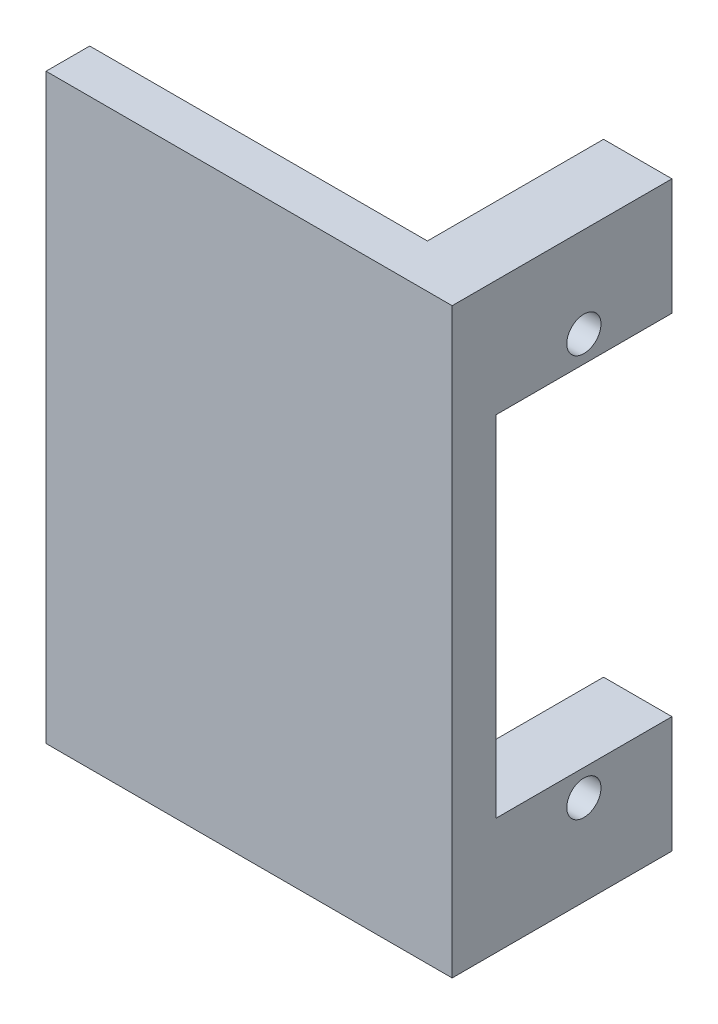
ISO-10303-21;
HEADER;
FILE_DESCRIPTION(('STEP AP214'),'2;1');
FILE_NAME('part.step','',(''),(''),'','','');
FILE_SCHEMA(('AUTOMOTIVE_DESIGN { 1 0 10303 214 1 1 1 1 }'));
ENDSEC;
DATA;
#1=APPLICATION_CONTEXT('core data for automotive mechanical design processes');
#2=APPLICATION_PROTOCOL_DEFINITION('international standard','automotive_design',2000,#1);
#3=PRODUCT_CONTEXT('',#1,'mechanical');
#4=PRODUCT('Part','Part','',(#3));
#5=PRODUCT_RELATED_PRODUCT_CATEGORY('part','',(#4));
#6=PRODUCT_DEFINITION_FORMATION('','',#4);
#7=PRODUCT_DEFINITION_CONTEXT('part definition',#1,'design');
#8=PRODUCT_DEFINITION('design','',#6,#7);
#9=PRODUCT_DEFINITION_SHAPE('','',#8);
#10=(LENGTH_UNIT() NAMED_UNIT(*) SI_UNIT(.MILLI.,.METRE.));
#11=(NAMED_UNIT(*) PLANE_ANGLE_UNIT() SI_UNIT($,.RADIAN.));
#12=(NAMED_UNIT(*) SI_UNIT($,.STERADIAN.) SOLID_ANGLE_UNIT());
#13=UNCERTAINTY_MEASURE_WITH_UNIT(LENGTH_MEASURE(1.E-05),#10,'distance_accuracy_value','');
#14=(GEOMETRIC_REPRESENTATION_CONTEXT(3) GLOBAL_UNCERTAINTY_ASSIGNED_CONTEXT((#13)) GLOBAL_UNIT_ASSIGNED_CONTEXT((#10,
#11,#12)) REPRESENTATION_CONTEXT('',''));
#15=CARTESIAN_POINT('',(0.,0.,0.));
#16=DIRECTION('',(0.,0.,1.));
#17=DIRECTION('',(1.,0.,0.));
#18=AXIS2_PLACEMENT_3D('',#15,#16,#17);
#19=CARTESIAN_POINT('',(0.,40.,-12.1));
#20=DIRECTION('',(1.,0.,0.));
#21=DIRECTION('',(0.,0.,-1.));
#22=AXIS2_PLACEMENT_3D('',#19,#20,#21);
#23=PLANE('',#22);
#24=CARTESIAN_POINT('',(0.,6.2,-6.05));
#25=DIRECTION('',(1.,0.,0.));
#26=DIRECTION('',(0.,0.,-1.));
#27=AXIS2_PLACEMENT_3D('',#24,#25,#26);
#28=CIRCLE('',#27,1.175);
#29=CARTESIAN_POINT('',(0.,6.2,-7.225));
#30=VERTEX_POINT('',#29);
#31=EDGE_CURVE('E251',#30,#30,#28,.F.);
#32=ORIENTED_EDGE('',*,*,#31,.F.);
#33=EDGE_LOOP('',(#32));
#34=FACE_BOUND('',#33,.T.);
#35=DIRECTION('',(0.,-1.,0.));
#36=VECTOR('',#35,1.);
#37=CARTESIAN_POINT('',(0.,40.,0.));
#38=LINE('',#37,#36);
#39=CARTESIAN_POINT('',(0.,8.,0.));
#40=VERTEX_POINT('',#39);
#41=CARTESIAN_POINT('',(0.,0.,0.));
#42=VERTEX_POINT('',#41);
#43=EDGE_CURVE('E48',#40,#42,#38,.T.);
#44=ORIENTED_EDGE('',*,*,#43,.F.);
#45=DIRECTION('',(0.,0.,1.));
#46=VECTOR('',#45,1.);
#47=CARTESIAN_POINT('',(0.,8.,0.));
#48=LINE('',#47,#46);
#49=CARTESIAN_POINT('',(0.,8.,-12.1));
#50=VERTEX_POINT('',#49);
#51=EDGE_CURVE('E230',#50,#40,#48,.T.);
#52=ORIENTED_EDGE('',*,*,#51,.F.);
#53=DIRECTION('',(0.,-1.,0.));
#54=VECTOR('',#53,1.);
#55=CARTESIAN_POINT('',(0.,40.,-12.1));
#56=LINE('',#55,#54);
#57=CARTESIAN_POINT('',(0.,0.,-12.1));
#58=VERTEX_POINT('',#57);
#59=EDGE_CURVE('E92',#50,#58,#56,.T.);
#60=ORIENTED_EDGE('',*,*,#59,.T.);
#61=DIRECTION('',(0.,0.,1.));
#62=VECTOR('',#61,1.);
#63=CARTESIAN_POINT('',(0.,0.,-12.1));
#64=LINE('',#63,#62);
#65=EDGE_CURVE('E145',#58,#42,#64,.T.);
#66=ORIENTED_EDGE('',*,*,#65,.T.);
#67=EDGE_LOOP('',(#44,#52,#60,#66));
#68=FACE_BOUND('',#67,.T.);
#69=ADVANCED_FACE('F39',(#34,#68),#23,.F.);
#70=CARTESIAN_POINT('',(0.,40.,-12.1));
#71=DIRECTION('',(0.,0.,1.));
#72=DIRECTION('',(1.,0.,0.));
#73=AXIS2_PLACEMENT_3D('',#70,#71,#72);
#74=PLANE('',#73);
#75=ORIENTED_EDGE('',*,*,#59,.F.);
#76=DIRECTION('',(1.,0.,0.));
#77=VECTOR('',#76,1.);
#78=CARTESIAN_POINT('',(-26.8776859122953,8.,-12.1));
#79=LINE('',#78,#77);
#80=CARTESIAN_POINT('',(4.7,8.,-12.1));
#81=VERTEX_POINT('',#80);
#82=EDGE_CURVE('E238',#50,#81,#79,.T.);
#83=ORIENTED_EDGE('',*,*,#82,.T.);
#84=DIRECTION('',(0.,-1.,0.));
#85=VECTOR('',#84,1.);
#86=CARTESIAN_POINT('',(4.7,40.,-12.1));
#87=LINE('',#86,#85);
#88=CARTESIAN_POINT('',(4.7,0.,-12.1));
#89=VERTEX_POINT('',#88);
#90=EDGE_CURVE('E167',#81,#89,#87,.T.);
#91=ORIENTED_EDGE('',*,*,#90,.T.);
#92=DIRECTION('',(-1.,0.,0.));
#93=VECTOR('',#92,1.);
#94=CARTESIAN_POINT('',(0.,0.,-12.1));
#95=LINE('',#94,#93);
#96=EDGE_CURVE('E159',#89,#58,#95,.T.);
#97=ORIENTED_EDGE('',*,*,#96,.T.);
#98=EDGE_LOOP('',(#75,#83,#91,#97));
#99=FACE_BOUND('',#98,.T.);
#100=ADVANCED_FACE('F189',(#99),#74,.F.);
#101=CARTESIAN_POINT('',(0.,33.8,-6.05));
#102=DIRECTION('',(1.,0.,0.));
#103=DIRECTION('',(0.,0.,-1.));
#104=AXIS2_PLACEMENT_3D('',#101,#102,#103);
#105=CIRCLE('',#104,1.175);
#106=CARTESIAN_POINT('',(0.,33.8,-7.225));
#107=VERTEX_POINT('',#106);
#108=EDGE_CURVE('E207',#107,#107,#105,.F.);
#109=ORIENTED_EDGE('',*,*,#108,.F.);
#110=EDGE_LOOP('',(#109));
#111=FACE_BOUND('',#110,.T.);
#112=CARTESIAN_POINT('',(0.,40.,-12.1));
#113=VERTEX_POINT('',#112);
#114=CARTESIAN_POINT('',(0.,32.,-12.1));
#115=VERTEX_POINT('',#114);
#116=EDGE_CURVE('E163',#113,#115,#56,.T.);
#117=ORIENTED_EDGE('',*,*,#116,.T.);
#118=DIRECTION('',(0.,0.,-1.));
#119=VECTOR('',#118,1.);
#120=CARTESIAN_POINT('',(0.,32.,0.));
#121=LINE('',#120,#119);
#122=CARTESIAN_POINT('',(0.,32.,0.));
#123=VERTEX_POINT('',#122);
#124=EDGE_CURVE('E55',#123,#115,#121,.T.);
#125=ORIENTED_EDGE('',*,*,#124,.F.);
#126=CARTESIAN_POINT('',(0.,40.,0.));
#127=VERTEX_POINT('',#126);
#128=EDGE_CURVE('E11',#127,#123,#38,.T.);
#129=ORIENTED_EDGE('',*,*,#128,.F.);
#130=DIRECTION('',(0.,0.,1.));
#131=VECTOR('',#130,1.);
#132=CARTESIAN_POINT('',(0.,40.,-12.1));
#133=LINE('',#132,#131);
#134=EDGE_CURVE('E162',#113,#127,#133,.T.);
#135=ORIENTED_EDGE('',*,*,#134,.F.);
#136=EDGE_LOOP('',(#117,#125,#129,#135));
#137=FACE_BOUND('',#136,.T.);
#138=ADVANCED_FACE('F41',(#111,#137),#23,.F.);
#139=CARTESIAN_POINT('',(-23.2,40.,0.));
#140=DIRECTION('',(0.,0.,1.));
#141=DIRECTION('',(1.,0.,0.));
#142=AXIS2_PLACEMENT_3D('',#139,#140,#141);
#143=PLANE('',#142);
#144=DIRECTION('',(-1.,0.,0.));
#145=VECTOR('',#144,1.);
#146=CARTESIAN_POINT('',(-23.2,0.,0.));
#147=LINE('',#146,#145);
#148=CARTESIAN_POINT('',(-23.2,0.,0.));
#149=VERTEX_POINT('',#148);
#150=EDGE_CURVE('E148',#42,#149,#147,.T.);
#151=ORIENTED_EDGE('',*,*,#150,.T.);
#152=DIRECTION('',(0.,-1.,0.));
#153=VECTOR('',#152,1.);
#154=CARTESIAN_POINT('',(-23.2,40.,0.));
#155=LINE('',#154,#153);
#156=CARTESIAN_POINT('',(-23.2,40.,0.));
#157=VERTEX_POINT('',#156);
#158=EDGE_CURVE('E171',#157,#149,#155,.T.);
#159=ORIENTED_EDGE('',*,*,#158,.F.);
#160=DIRECTION('',(-1.,0.,0.));
#161=VECTOR('',#160,1.);
#162=CARTESIAN_POINT('',(-23.2,40.,0.));
#163=LINE('',#162,#161);
#164=EDGE_CURVE('E100',#127,#157,#163,.T.);
#165=ORIENTED_EDGE('',*,*,#164,.F.);
#166=ORIENTED_EDGE('',*,*,#128,.T.);
#167=DIRECTION('',(1.,0.,0.));
#168=VECTOR('',#167,1.);
#169=CARTESIAN_POINT('',(-26.8776859122953,32.,0.));
#170=LINE('',#169,#168);
#171=CARTESIAN_POINT('',(4.7,32.,0.));
#172=VERTEX_POINT('',#171);
#173=EDGE_CURVE('E216',#123,#172,#170,.T.);
#174=ORIENTED_EDGE('',*,*,#173,.T.);
#175=DIRECTION('',(0.,-1.,0.));
#176=VECTOR('',#175,1.);
#177=CARTESIAN_POINT('',(4.7,32.,0.));
#178=LINE('',#177,#176);
#179=CARTESIAN_POINT('',(4.7,8.,0.));
#180=VERTEX_POINT('',#179);
#181=EDGE_CURVE('E224',#172,#180,#178,.T.);
#182=ORIENTED_EDGE('',*,*,#181,.T.);
#183=DIRECTION('',(1.,0.,0.));
#184=VECTOR('',#183,1.);
#185=CARTESIAN_POINT('',(-26.8776859122953,8.,0.));
#186=LINE('',#185,#184);
#187=EDGE_CURVE('E183',#40,#180,#186,.T.);
#188=ORIENTED_EDGE('',*,*,#187,.F.);
#189=ORIENTED_EDGE('',*,*,#43,.T.);
#190=EDGE_LOOP('',(#151,#159,#165,#166,#174,#182,#188,#189));
#191=FACE_BOUND('',#190,.T.);
#192=ADVANCED_FACE('F180',(#191),#143,.F.);
#193=CARTESIAN_POINT('',(-23.2,40.,3.));
#194=DIRECTION('',(1.,0.,0.));
#195=DIRECTION('',(0.,0.,-1.));
#196=AXIS2_PLACEMENT_3D('',#193,#194,#195);
#197=PLANE('',#196);
#198=DIRECTION('',(0.,0.,1.));
#199=VECTOR('',#198,1.);
#200=CARTESIAN_POINT('',(-23.2,0.,3.));
#201=LINE('',#200,#199);
#202=CARTESIAN_POINT('',(-23.2,0.,3.));
#203=VERTEX_POINT('',#202);
#204=EDGE_CURVE('E151',#149,#203,#201,.T.);
#205=ORIENTED_EDGE('',*,*,#204,.T.);
#206=DIRECTION('',(0.,-1.,0.));
#207=VECTOR('',#206,1.);
#208=CARTESIAN_POINT('',(-23.2,40.,3.));
#209=LINE('',#208,#207);
#210=CARTESIAN_POINT('',(-23.2,40.,3.));
#211=VERTEX_POINT('',#210);
#212=EDGE_CURVE('E132',#211,#203,#209,.T.);
#213=ORIENTED_EDGE('',*,*,#212,.F.);
#214=DIRECTION('',(0.,0.,1.));
#215=VECTOR('',#214,1.);
#216=CARTESIAN_POINT('',(-23.2,40.,3.));
#217=LINE('',#216,#215);
#218=EDGE_CURVE('E117',#157,#211,#217,.T.);
#219=ORIENTED_EDGE('',*,*,#218,.F.);
#220=ORIENTED_EDGE('',*,*,#158,.T.);
#221=EDGE_LOOP('',(#205,#213,#219,#220));
#222=FACE_BOUND('',#221,.T.);
#223=ADVANCED_FACE('F203',(#222),#197,.F.);
#224=CARTESIAN_POINT('',(4.7,40.,3.));
#225=DIRECTION('',(0.,0.,-1.));
#226=DIRECTION('',(-1.,0.,0.));
#227=AXIS2_PLACEMENT_3D('',#224,#225,#226);
#228=PLANE('',#227);
#229=DIRECTION('',(1.,0.,0.));
#230=VECTOR('',#229,1.);
#231=CARTESIAN_POINT('',(4.7,0.,3.));
#232=LINE('',#231,#230);
#233=CARTESIAN_POINT('',(4.7,0.,3.));
#234=VERTEX_POINT('',#233);
#235=EDGE_CURVE('E127',#203,#234,#232,.T.);
#236=ORIENTED_EDGE('',*,*,#235,.T.);
#237=DIRECTION('',(0.,-1.,0.));
#238=VECTOR('',#237,1.);
#239=CARTESIAN_POINT('',(4.7,40.,3.));
#240=LINE('',#239,#238);
#241=CARTESIAN_POINT('',(4.7,40.,3.));
#242=VERTEX_POINT('',#241);
#243=EDGE_CURVE('E124',#242,#234,#240,.T.);
#244=ORIENTED_EDGE('',*,*,#243,.F.);
#245=DIRECTION('',(1.,0.,0.));
#246=VECTOR('',#245,1.);
#247=CARTESIAN_POINT('',(4.7,40.,3.));
#248=LINE('',#247,#246);
#249=EDGE_CURVE('E110',#211,#242,#248,.T.);
#250=ORIENTED_EDGE('',*,*,#249,.F.);
#251=ORIENTED_EDGE('',*,*,#212,.T.);
#252=EDGE_LOOP('',(#236,#244,#250,#251));
#253=FACE_BOUND('',#252,.T.);
#254=ADVANCED_FACE('F125',(#253),#228,.F.);
#255=CARTESIAN_POINT('',(4.7,40.,-12.1));
#256=DIRECTION('',(-1.,0.,0.));
#257=DIRECTION('',(0.,0.,1.));
#258=AXIS2_PLACEMENT_3D('',#255,#256,#257);
#259=PLANE('',#258);
#260=CARTESIAN_POINT('',(4.7,33.8,-6.05));
#261=DIRECTION('',(1.,0.,0.));
#262=DIRECTION('',(0.,0.,-1.));
#263=AXIS2_PLACEMENT_3D('',#260,#261,#262);
#264=CIRCLE('',#263,1.175);
#265=CARTESIAN_POINT('',(4.7,33.8,-7.225));
#266=VERTEX_POINT('',#265);
#267=EDGE_CURVE('E255',#266,#266,#264,.T.);
#268=ORIENTED_EDGE('',*,*,#267,.F.);
#269=EDGE_LOOP('',(#268));
#270=FACE_BOUND('',#269,.T.);
#271=CARTESIAN_POINT('',(4.7,6.2,-6.05));
#272=DIRECTION('',(1.,0.,0.));
#273=DIRECTION('',(0.,0.,-1.));
#274=AXIS2_PLACEMENT_3D('',#271,#272,#273);
#275=CIRCLE('',#274,1.175);
#276=CARTESIAN_POINT('',(4.7,6.2,-7.225));
#277=VERTEX_POINT('',#276);
#278=EDGE_CURVE('E256',#277,#277,#275,.T.);
#279=ORIENTED_EDGE('',*,*,#278,.F.);
#280=EDGE_LOOP('',(#279));
#281=FACE_BOUND('',#280,.T.);
#282=ORIENTED_EDGE('',*,*,#90,.F.);
#283=DIRECTION('',(0.,0.,-1.));
#284=VECTOR('',#283,1.);
#285=CARTESIAN_POINT('',(4.7,8.,0.));
#286=LINE('',#285,#284);
#287=EDGE_CURVE('E217',#180,#81,#286,.T.);
#288=ORIENTED_EDGE('',*,*,#287,.F.);
#289=ORIENTED_EDGE('',*,*,#181,.F.);
#290=DIRECTION('',(0.,0.,1.));
#291=VECTOR('',#290,1.);
#292=CARTESIAN_POINT('',(4.7,32.,0.));
#293=LINE('',#292,#291);
#294=CARTESIAN_POINT('',(4.7,32.,-12.1));
#295=VERTEX_POINT('',#294);
#296=EDGE_CURVE('E248',#295,#172,#293,.T.);
#297=ORIENTED_EDGE('',*,*,#296,.F.);
#298=CARTESIAN_POINT('',(4.7,40.,-12.1));
#299=VERTEX_POINT('',#298);
#300=EDGE_CURVE('E133',#299,#295,#87,.T.);
#301=ORIENTED_EDGE('',*,*,#300,.F.);
#302=DIRECTION('',(0.,0.,-1.));
#303=VECTOR('',#302,1.);
#304=CARTESIAN_POINT('',(4.7,40.,-12.1));
#305=LINE('',#304,#303);
#306=EDGE_CURVE('E114',#242,#299,#305,.T.);
#307=ORIENTED_EDGE('',*,*,#306,.F.);
#308=ORIENTED_EDGE('',*,*,#243,.T.);
#309=DIRECTION('',(0.,0.,-1.));
#310=VECTOR('',#309,1.);
#311=CARTESIAN_POINT('',(4.7,0.,-12.1));
#312=LINE('',#311,#310);
#313=EDGE_CURVE('E156',#234,#89,#312,.T.);
#314=ORIENTED_EDGE('',*,*,#313,.T.);
#315=EDGE_LOOP('',(#282,#288,#289,#297,#301,#307,#308,#314));
#316=FACE_BOUND('',#315,.T.);
#317=ADVANCED_FACE('F136',(#270,#281,#316),#259,.F.);
#318=ORIENTED_EDGE('',*,*,#300,.T.);
#319=DIRECTION('',(1.,0.,0.));
#320=VECTOR('',#319,1.);
#321=CARTESIAN_POINT('',(-26.8776859122953,32.,-12.1));
#322=LINE('',#321,#320);
#323=EDGE_CURVE('E212',#115,#295,#322,.T.);
#324=ORIENTED_EDGE('',*,*,#323,.F.);
#325=ORIENTED_EDGE('',*,*,#116,.F.);
#326=DIRECTION('',(-1.,0.,0.));
#327=VECTOR('',#326,1.);
#328=CARTESIAN_POINT('',(0.,40.,-12.1));
#329=LINE('',#328,#327);
#330=EDGE_CURVE('E64',#299,#113,#329,.T.);
#331=ORIENTED_EDGE('',*,*,#330,.F.);
#332=EDGE_LOOP('',(#318,#324,#325,#331));
#333=FACE_BOUND('',#332,.T.);
#334=ADVANCED_FACE('F196',(#333),#74,.F.);
#335=CARTESIAN_POINT('',(0.,40.,0.));
#336=DIRECTION('',(0.,1.,0.));
#337=DIRECTION('',(0.,0.,1.));
#338=AXIS2_PLACEMENT_3D('',#335,#336,#337);
#339=PLANE('',#338);
#340=ORIENTED_EDGE('',*,*,#134,.T.);
#341=ORIENTED_EDGE('',*,*,#164,.T.);
#342=ORIENTED_EDGE('',*,*,#218,.T.);
#343=ORIENTED_EDGE('',*,*,#249,.T.);
#344=ORIENTED_EDGE('',*,*,#306,.T.);
#345=ORIENTED_EDGE('',*,*,#330,.T.);
#346=EDGE_LOOP('',(#340,#341,#342,#343,#344,#345));
#347=FACE_BOUND('',#346,.T.);
#348=ADVANCED_FACE('F112',(#347),#339,.T.);
#349=CARTESIAN_POINT('',(0.,0.,0.));
#350=DIRECTION('',(0.,1.,0.));
#351=DIRECTION('',(0.,0.,1.));
#352=AXIS2_PLACEMENT_3D('',#349,#350,#351);
#353=PLANE('',#352);
#354=ORIENTED_EDGE('',*,*,#65,.F.);
#355=ORIENTED_EDGE('',*,*,#96,.F.);
#356=ORIENTED_EDGE('',*,*,#313,.F.);
#357=ORIENTED_EDGE('',*,*,#235,.F.);
#358=ORIENTED_EDGE('',*,*,#204,.F.);
#359=ORIENTED_EDGE('',*,*,#150,.F.);
#360=EDGE_LOOP('',(#354,#355,#356,#357,#358,#359));
#361=FACE_BOUND('',#360,.T.);
#362=ADVANCED_FACE('F186',(#361),#353,.F.);
#363=CARTESIAN_POINT('',(-26.8776859122953,8.,0.));
#364=DIRECTION('',(0.,-1.,0.));
#365=DIRECTION('',(0.,0.,-1.));
#366=AXIS2_PLACEMENT_3D('',#363,#364,#365);
#367=PLANE('',#366);
#368=ORIENTED_EDGE('',*,*,#51,.T.);
#369=ORIENTED_EDGE('',*,*,#187,.T.);
#370=ORIENTED_EDGE('',*,*,#287,.T.);
#371=ORIENTED_EDGE('',*,*,#82,.F.);
#372=EDGE_LOOP('',(#368,#369,#370,#371));
#373=FACE_BOUND('',#372,.T.);
#374=ADVANCED_FACE('F284',(#373),#367,.F.);
#375=CARTESIAN_POINT('',(-26.8776859122953,32.,0.));
#376=DIRECTION('',(0.,1.,0.));
#377=DIRECTION('',(0.,0.,1.));
#378=AXIS2_PLACEMENT_3D('',#375,#376,#377);
#379=PLANE('',#378);
#380=ORIENTED_EDGE('',*,*,#124,.T.);
#381=ORIENTED_EDGE('',*,*,#323,.T.);
#382=ORIENTED_EDGE('',*,*,#296,.T.);
#383=ORIENTED_EDGE('',*,*,#173,.F.);
#384=EDGE_LOOP('',(#380,#381,#382,#383));
#385=FACE_BOUND('',#384,.T.);
#386=ADVANCED_FACE('F275',(#385),#379,.F.);
#387=CARTESIAN_POINT('',(-3.32340187157678,6.2,-6.05));
#388=DIRECTION('',(1.,0.,0.));
#389=DIRECTION('',(0.,0.,-1.));
#390=AXIS2_PLACEMENT_3D('',#387,#388,#389);
#391=CYLINDRICAL_SURFACE('',#390,1.175);
#392=ORIENTED_EDGE('',*,*,#31,.T.);
#393=EDGE_LOOP('',(#392));
#394=FACE_BOUND('',#393,.T.);
#395=ORIENTED_EDGE('',*,*,#278,.T.);
#396=EDGE_LOOP('',(#395));
#397=FACE_BOUND('',#396,.T.);
#398=ADVANCED_FACE('F273',(#394,#397),#391,.F.);
#399=CARTESIAN_POINT('',(-3.32340187157678,33.8,-6.05));
#400=DIRECTION('',(1.,0.,0.));
#401=DIRECTION('',(0.,0.,-1.));
#402=AXIS2_PLACEMENT_3D('',#399,#400,#401);
#403=CYLINDRICAL_SURFACE('',#402,1.175);
#404=ORIENTED_EDGE('',*,*,#108,.T.);
#405=EDGE_LOOP('',(#404));
#406=FACE_BOUND('',#405,.T.);
#407=ORIENTED_EDGE('',*,*,#267,.T.);
#408=EDGE_LOOP('',(#407));
#409=FACE_BOUND('',#408,.T.);
#410=ADVANCED_FACE('F266',(#406,#409),#403,.F.);
#411=CLOSED_SHELL('',(#69,#100,#138,#192,#223,#254,#317,#334,#348,#362,#374,#386,#398,#410));
#412=MANIFOLD_SOLID_BREP('B2',#411);
#413=ADVANCED_BREP_SHAPE_REPRESENTATION('',(#18,#412),#14);
#414=SHAPE_DEFINITION_REPRESENTATION(#9,#413);
ENDSEC;
END-ISO-10303-21;
